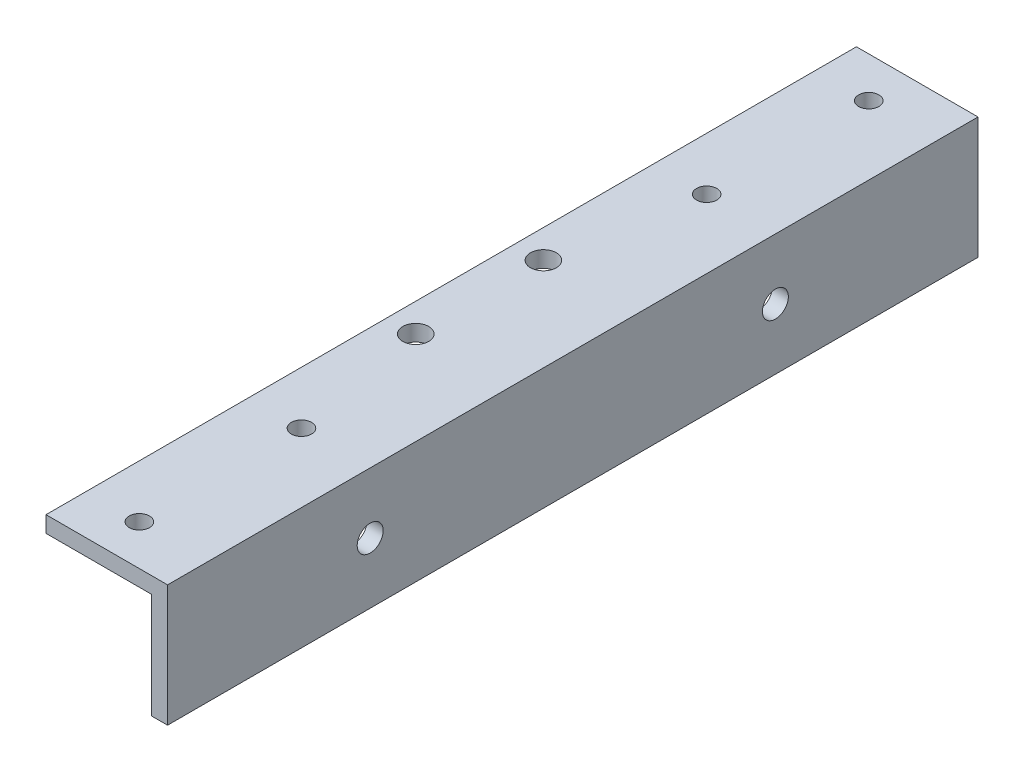
ISO-10303-21;
HEADER;
FILE_DESCRIPTION(('STEP AP214'),'2;1');
FILE_NAME('part.step','',(''),(''),'','','');
FILE_SCHEMA(('AUTOMOTIVE_DESIGN { 1 0 10303 214 1 1 1 1 }'));
ENDSEC;
DATA;
#1=APPLICATION_CONTEXT('core data for automotive mechanical design processes');
#2=APPLICATION_PROTOCOL_DEFINITION('international standard','automotive_design',2000,#1);
#3=PRODUCT_CONTEXT('',#1,'mechanical');
#4=PRODUCT('Part','Part','',(#3));
#5=PRODUCT_RELATED_PRODUCT_CATEGORY('part','',(#4));
#6=PRODUCT_DEFINITION_FORMATION('','',#4);
#7=PRODUCT_DEFINITION_CONTEXT('part definition',#1,'design');
#8=PRODUCT_DEFINITION('design','',#6,#7);
#9=PRODUCT_DEFINITION_SHAPE('','',#8);
#10=(LENGTH_UNIT() NAMED_UNIT(*) SI_UNIT(.MILLI.,.METRE.));
#11=(NAMED_UNIT(*) PLANE_ANGLE_UNIT() SI_UNIT($,.RADIAN.));
#12=(NAMED_UNIT(*) SI_UNIT($,.STERADIAN.) SOLID_ANGLE_UNIT());
#13=UNCERTAINTY_MEASURE_WITH_UNIT(LENGTH_MEASURE(1.E-05),#10,'distance_accuracy_value','');
#14=(GEOMETRIC_REPRESENTATION_CONTEXT(3) GLOBAL_UNCERTAINTY_ASSIGNED_CONTEXT((#13)) GLOBAL_UNIT_ASSIGNED_CONTEXT((#10,
#11,#12)) REPRESENTATION_CONTEXT('',''));
#15=CARTESIAN_POINT('',(0.,0.,0.));
#16=DIRECTION('',(0.,0.,1.));
#17=DIRECTION('',(1.,0.,0.));
#18=AXIS2_PLACEMENT_3D('',#15,#16,#17);
#19=CARTESIAN_POINT('',(0.,-2.,100.));
#20=DIRECTION('',(1.,0.,0.));
#21=DIRECTION('',(0.,0.,-1.));
#22=AXIS2_PLACEMENT_3D('',#19,#20,#21);
#23=PLANE('',#22);
#24=DIRECTION('',(0.,-1.,0.));
#25=VECTOR('',#24,1.);
#26=CARTESIAN_POINT('',(0.,-2.,0.));
#27=LINE('',#26,#25);
#28=CARTESIAN_POINT('',(0.,0.,0.));
#29=VERTEX_POINT('',#28);
#30=CARTESIAN_POINT('',(0.,-2.,0.));
#31=VERTEX_POINT('',#30);
#32=EDGE_CURVE('E121',#29,#31,#27,.T.);
#33=ORIENTED_EDGE('',*,*,#32,.T.);
#34=DIRECTION('',(0.,0.,-1.));
#35=VECTOR('',#34,1.);
#36=CARTESIAN_POINT('',(0.,-2.,100.));
#37=LINE('',#36,#35);
#38=CARTESIAN_POINT('',(0.,-2.,100.));
#39=VERTEX_POINT('',#38);
#40=EDGE_CURVE('E11',#39,#31,#37,.T.);
#41=ORIENTED_EDGE('',*,*,#40,.F.);
#42=DIRECTION('',(0.,-1.,0.));
#43=VECTOR('',#42,1.);
#44=CARTESIAN_POINT('',(0.,-2.,100.));
#45=LINE('',#44,#43);
#46=CARTESIAN_POINT('',(0.,0.,100.));
#47=VERTEX_POINT('',#46);
#48=EDGE_CURVE('E132',#47,#39,#45,.T.);
#49=ORIENTED_EDGE('',*,*,#48,.F.);
#50=DIRECTION('',(0.,0.,-1.));
#51=VECTOR('',#50,1.);
#52=CARTESIAN_POINT('',(0.,0.,100.));
#53=LINE('',#52,#51);
#54=EDGE_CURVE('E117',#47,#29,#53,.T.);
#55=ORIENTED_EDGE('',*,*,#54,.T.);
#56=EDGE_LOOP('',(#33,#41,#49,#55));
#57=FACE_BOUND('',#56,.T.);
#58=ADVANCED_FACE('F35',(#57),#23,.F.);
#59=CARTESIAN_POINT('',(13.,-2.,100.));
#60=DIRECTION('',(0.,1.,0.));
#61=DIRECTION('',(-1.,0.,0.));
#62=AXIS2_PLACEMENT_3D('',#59,#60,#61);
#63=PLANE('',#62);
#64=CARTESIAN_POINT('',(6.52,-2.,75.));
#65=DIRECTION('',(0.,1.,0.));
#66=DIRECTION('',(-1.,0.,0.));
#67=AXIS2_PLACEMENT_3D('',#64,#65,#66);
#68=CIRCLE('',#67,1.24999999999999);
#69=CARTESIAN_POINT('',(5.27000000000001,-2.,75.));
#70=VERTEX_POINT('',#69);
#71=EDGE_CURVE('E38',#70,#70,#68,.T.);
#72=ORIENTED_EDGE('',*,*,#71,.T.);
#73=EDGE_LOOP('',(#72));
#74=FACE_BOUND('',#73,.T.);
#75=CARTESIAN_POINT('',(6.52,-2.,25.));
#76=DIRECTION('',(0.,1.,0.));
#77=DIRECTION('',(-1.,0.,0.));
#78=AXIS2_PLACEMENT_3D('',#75,#76,#77);
#79=CIRCLE('',#78,1.24999999999999);
#80=CARTESIAN_POINT('',(5.27000000000001,-2.,25.));
#81=VERTEX_POINT('',#80);
#82=EDGE_CURVE('E351',#81,#81,#79,.T.);
#83=ORIENTED_EDGE('',*,*,#82,.T.);
#84=EDGE_LOOP('',(#83));
#85=FACE_BOUND('',#84,.T.);
#86=CARTESIAN_POINT('',(6.52,-2.,95.));
#87=DIRECTION('',(0.,1.,0.));
#88=DIRECTION('',(-1.,0.,0.));
#89=AXIS2_PLACEMENT_3D('',#86,#87,#88);
#90=CIRCLE('',#89,1.24999999999999);
#91=CARTESIAN_POINT('',(5.27000000000002,-2.,95.));
#92=VERTEX_POINT('',#91);
#93=EDGE_CURVE('E147',#92,#92,#90,.T.);
#94=ORIENTED_EDGE('',*,*,#93,.T.);
#95=EDGE_LOOP('',(#94));
#96=FACE_BOUND('',#95,.T.);
#97=CARTESIAN_POINT('',(6.52,-2.,5.));
#98=DIRECTION('',(0.,1.,0.));
#99=DIRECTION('',(-1.,0.,0.));
#100=AXIS2_PLACEMENT_3D('',#97,#98,#99);
#101=CIRCLE('',#100,1.24999999999999);
#102=CARTESIAN_POINT('',(5.27000000000001,-2.,5.));
#103=VERTEX_POINT('',#102);
#104=EDGE_CURVE('E137',#103,#103,#101,.T.);
#105=ORIENTED_EDGE('',*,*,#104,.T.);
#106=EDGE_LOOP('',(#105));
#107=FACE_BOUND('',#106,.T.);
#108=CARTESIAN_POINT('',(3.5,-2.,57.875));
#109=DIRECTION('',(0.,1.,0.));
#110=DIRECTION('',(0.,0.,1.));
#111=AXIS2_PLACEMENT_3D('',#108,#109,#110);
#112=CIRCLE('',#111,1.6);
#113=CARTESIAN_POINT('',(3.5,-2.,59.475));
#114=VERTEX_POINT('',#113);
#115=EDGE_CURVE('E125',#114,#114,#112,.T.);
#116=ORIENTED_EDGE('',*,*,#115,.T.);
#117=EDGE_LOOP('',(#116));
#118=FACE_BOUND('',#117,.T.);
#119=CARTESIAN_POINT('',(3.5,-2.,42.125));
#120=DIRECTION('',(0.,1.,0.));
#121=DIRECTION('',(0.,0.,1.));
#122=AXIS2_PLACEMENT_3D('',#119,#120,#121);
#123=CIRCLE('',#122,1.6);
#124=CARTESIAN_POINT('',(3.5,-2.,43.725));
#125=VERTEX_POINT('',#124);
#126=EDGE_CURVE('E144',#125,#125,#123,.T.);
#127=ORIENTED_EDGE('',*,*,#126,.T.);
#128=EDGE_LOOP('',(#127));
#129=FACE_BOUND('',#128,.T.);
#130=DIRECTION('',(1.,0.,0.));
#131=VECTOR('',#130,1.);
#132=CARTESIAN_POINT('',(13.,-2.,0.));
#133=LINE('',#132,#131);
#134=CARTESIAN_POINT('',(13.,-2.,0.));
#135=VERTEX_POINT('',#134);
#136=EDGE_CURVE('E124',#31,#135,#133,.T.);
#137=ORIENTED_EDGE('',*,*,#136,.T.);
#138=DIRECTION('',(0.,0.,-1.));
#139=VECTOR('',#138,1.);
#140=CARTESIAN_POINT('',(13.,-2.,100.));
#141=LINE('',#140,#139);
#142=CARTESIAN_POINT('',(13.,-2.,100.));
#143=VERTEX_POINT('',#142);
#144=EDGE_CURVE('E44',#143,#135,#141,.T.);
#145=ORIENTED_EDGE('',*,*,#144,.F.);
#146=DIRECTION('',(1.,0.,0.));
#147=VECTOR('',#146,1.);
#148=CARTESIAN_POINT('',(13.,-2.,100.));
#149=LINE('',#148,#147);
#150=EDGE_CURVE('E90',#39,#143,#149,.T.);
#151=ORIENTED_EDGE('',*,*,#150,.F.);
#152=ORIENTED_EDGE('',*,*,#40,.T.);
#153=EDGE_LOOP('',(#137,#145,#151,#152));
#154=FACE_BOUND('',#153,.T.);
#155=ADVANCED_FACE('F166',(#74,#85,#96,#107,#118,#129,#154),#63,.F.);
#156=CARTESIAN_POINT('',(13.,-15.,100.));
#157=DIRECTION('',(1.,0.,0.));
#158=DIRECTION('',(0.,0.,-1.));
#159=AXIS2_PLACEMENT_3D('',#156,#157,#158);
#160=PLANE('',#159);
#161=CARTESIAN_POINT('',(13.,-7.5,75.));
#162=DIRECTION('',(1.,0.,0.));
#163=DIRECTION('',(0.,0.,-1.));
#164=AXIS2_PLACEMENT_3D('',#161,#162,#163);
#165=CIRCLE('',#164,1.60000000000001);
#166=CARTESIAN_POINT('',(13.,-7.5,73.4));
#167=VERTEX_POINT('',#166);
#168=EDGE_CURVE('E361',#167,#167,#165,.T.);
#169=ORIENTED_EDGE('',*,*,#168,.T.);
#170=EDGE_LOOP('',(#169));
#171=FACE_BOUND('',#170,.T.);
#172=CARTESIAN_POINT('',(13.,-7.49999999999999,25.));
#173=DIRECTION('',(1.,0.,0.));
#174=DIRECTION('',(0.,0.,-1.));
#175=AXIS2_PLACEMENT_3D('',#172,#173,#174);
#176=CIRCLE('',#175,1.6);
#177=CARTESIAN_POINT('',(13.,-7.49999999999999,23.4));
#178=VERTEX_POINT('',#177);
#179=EDGE_CURVE('E364',#178,#178,#176,.T.);
#180=ORIENTED_EDGE('',*,*,#179,.T.);
#181=EDGE_LOOP('',(#180));
#182=FACE_BOUND('',#181,.T.);
#183=DIRECTION('',(0.,-1.,0.));
#184=VECTOR('',#183,1.);
#185=CARTESIAN_POINT('',(13.,-15.,0.));
#186=LINE('',#185,#184);
#187=CARTESIAN_POINT('',(13.,-15.,0.));
#188=VERTEX_POINT('',#187);
#189=EDGE_CURVE('E127',#135,#188,#186,.T.);
#190=ORIENTED_EDGE('',*,*,#189,.T.);
#191=DIRECTION('',(0.,0.,-1.));
#192=VECTOR('',#191,1.);
#193=CARTESIAN_POINT('',(13.,-15.,100.));
#194=LINE('',#193,#192);
#195=CARTESIAN_POINT('',(13.,-15.,100.));
#196=VERTEX_POINT('',#195);
#197=EDGE_CURVE('E112',#196,#188,#194,.T.);
#198=ORIENTED_EDGE('',*,*,#197,.F.);
#199=DIRECTION('',(0.,-1.,0.));
#200=VECTOR('',#199,1.);
#201=CARTESIAN_POINT('',(13.,-15.,100.));
#202=LINE('',#201,#200);
#203=EDGE_CURVE('E103',#143,#196,#202,.T.);
#204=ORIENTED_EDGE('',*,*,#203,.F.);
#205=ORIENTED_EDGE('',*,*,#144,.T.);
#206=EDGE_LOOP('',(#190,#198,#204,#205));
#207=FACE_BOUND('',#206,.T.);
#208=ADVANCED_FACE('F169',(#171,#182,#207),#160,.F.);
#209=CARTESIAN_POINT('',(15.,-15.,100.));
#210=DIRECTION('',(0.,1.,0.));
#211=DIRECTION('',(-1.,0.,0.));
#212=AXIS2_PLACEMENT_3D('',#209,#210,#211);
#213=PLANE('',#212);
#214=DIRECTION('',(1.,0.,0.));
#215=VECTOR('',#214,1.);
#216=CARTESIAN_POINT('',(15.,-15.,0.));
#217=LINE('',#216,#215);
#218=CARTESIAN_POINT('',(15.,-15.,0.));
#219=VERTEX_POINT('',#218);
#220=EDGE_CURVE('E111',#188,#219,#217,.T.);
#221=ORIENTED_EDGE('',*,*,#220,.T.);
#222=DIRECTION('',(0.,0.,-1.));
#223=VECTOR('',#222,1.);
#224=CARTESIAN_POINT('',(15.,-15.,100.));
#225=LINE('',#224,#223);
#226=CARTESIAN_POINT('',(15.,-15.,100.));
#227=VERTEX_POINT('',#226);
#228=EDGE_CURVE('E108',#227,#219,#225,.T.);
#229=ORIENTED_EDGE('',*,*,#228,.F.);
#230=DIRECTION('',(1.,0.,0.));
#231=VECTOR('',#230,1.);
#232=CARTESIAN_POINT('',(15.,-15.,100.));
#233=LINE('',#232,#231);
#234=EDGE_CURVE('E97',#196,#227,#233,.T.);
#235=ORIENTED_EDGE('',*,*,#234,.F.);
#236=ORIENTED_EDGE('',*,*,#197,.T.);
#237=EDGE_LOOP('',(#221,#229,#235,#236));
#238=FACE_BOUND('',#237,.T.);
#239=ADVANCED_FACE('F109',(#238),#213,.F.);
#240=CARTESIAN_POINT('',(15.,0.,100.));
#241=DIRECTION('',(-1.,0.,0.));
#242=DIRECTION('',(0.,-1.,0.));
#243=AXIS2_PLACEMENT_3D('',#240,#241,#242);
#244=PLANE('',#243);
#245=CARTESIAN_POINT('',(15.,-7.5,75.));
#246=DIRECTION('',(1.,0.,0.));
#247=DIRECTION('',(0.,1.,0.));
#248=AXIS2_PLACEMENT_3D('',#245,#246,#247);
#249=CIRCLE('',#248,1.60000000000001);
#250=CARTESIAN_POINT('',(15.,-5.89999999999999,75.));
#251=VERTEX_POINT('',#250);
#252=EDGE_CURVE('E367',#251,#251,#249,.T.);
#253=ORIENTED_EDGE('',*,*,#252,.F.);
#254=EDGE_LOOP('',(#253));
#255=FACE_BOUND('',#254,.T.);
#256=CARTESIAN_POINT('',(15.,-7.49999999999999,25.));
#257=DIRECTION('',(1.,0.,0.));
#258=DIRECTION('',(0.,1.,0.));
#259=AXIS2_PLACEMENT_3D('',#256,#257,#258);
#260=CIRCLE('',#259,1.6);
#261=CARTESIAN_POINT('',(15.,-5.89999999999999,25.));
#262=VERTEX_POINT('',#261);
#263=EDGE_CURVE('E368',#262,#262,#260,.T.);
#264=ORIENTED_EDGE('',*,*,#263,.F.);
#265=EDGE_LOOP('',(#264));
#266=FACE_BOUND('',#265,.T.);
#267=DIRECTION('',(0.,1.,0.));
#268=VECTOR('',#267,1.);
#269=CARTESIAN_POINT('',(15.,0.,0.));
#270=LINE('',#269,#268);
#271=CARTESIAN_POINT('',(15.,0.,0.));
#272=VERTEX_POINT('',#271);
#273=EDGE_CURVE('E76',#219,#272,#270,.T.);
#274=ORIENTED_EDGE('',*,*,#273,.T.);
#275=DIRECTION('',(0.,0.,-1.));
#276=VECTOR('',#275,1.);
#277=CARTESIAN_POINT('',(15.,0.,100.));
#278=LINE('',#277,#276);
#279=CARTESIAN_POINT('',(15.,0.,100.));
#280=VERTEX_POINT('',#279);
#281=EDGE_CURVE('E113',#280,#272,#278,.T.);
#282=ORIENTED_EDGE('',*,*,#281,.F.);
#283=DIRECTION('',(0.,1.,0.));
#284=VECTOR('',#283,1.);
#285=CARTESIAN_POINT('',(15.,0.,100.));
#286=LINE('',#285,#284);
#287=EDGE_CURVE('E101',#227,#280,#286,.T.);
#288=ORIENTED_EDGE('',*,*,#287,.F.);
#289=ORIENTED_EDGE('',*,*,#228,.T.);
#290=EDGE_LOOP('',(#274,#282,#288,#289));
#291=FACE_BOUND('',#290,.T.);
#292=ADVANCED_FACE('F115',(#255,#266,#291),#244,.F.);
#293=CARTESIAN_POINT('',(0.,0.,100.));
#294=DIRECTION('',(0.,-1.,0.));
#295=DIRECTION('',(0.,0.,-1.));
#296=AXIS2_PLACEMENT_3D('',#293,#294,#295);
#297=PLANE('',#296);
#298=CARTESIAN_POINT('',(6.52,0.,75.));
#299=DIRECTION('',(0.,1.,0.));
#300=DIRECTION('',(0.,0.,1.));
#301=AXIS2_PLACEMENT_3D('',#298,#299,#300);
#302=CIRCLE('',#301,1.24999999999999);
#303=CARTESIAN_POINT('',(6.52,0.,76.25));
#304=VERTEX_POINT('',#303);
#305=EDGE_CURVE('E358',#304,#304,#302,.T.);
#306=ORIENTED_EDGE('',*,*,#305,.F.);
#307=EDGE_LOOP('',(#306));
#308=FACE_BOUND('',#307,.T.);
#309=CARTESIAN_POINT('',(6.52,0.,25.));
#310=DIRECTION('',(0.,1.,0.));
#311=DIRECTION('',(0.,0.,1.));
#312=AXIS2_PLACEMENT_3D('',#309,#310,#311);
#313=CIRCLE('',#312,1.24999999999999);
#314=CARTESIAN_POINT('',(6.52,0.,26.25));
#315=VERTEX_POINT('',#314);
#316=EDGE_CURVE('E353',#315,#315,#313,.T.);
#317=ORIENTED_EDGE('',*,*,#316,.F.);
#318=EDGE_LOOP('',(#317));
#319=FACE_BOUND('',#318,.T.);
#320=CARTESIAN_POINT('',(6.52,0.,95.));
#321=DIRECTION('',(0.,1.,0.));
#322=DIRECTION('',(0.,0.,1.));
#323=AXIS2_PLACEMENT_3D('',#320,#321,#322);
#324=CIRCLE('',#323,1.24999999999999);
#325=CARTESIAN_POINT('',(6.52,0.,96.25));
#326=VERTEX_POINT('',#325);
#327=EDGE_CURVE('E152',#326,#326,#324,.T.);
#328=ORIENTED_EDGE('',*,*,#327,.F.);
#329=EDGE_LOOP('',(#328));
#330=FACE_BOUND('',#329,.T.);
#331=CARTESIAN_POINT('',(6.52,0.,5.));
#332=DIRECTION('',(0.,1.,0.));
#333=DIRECTION('',(0.,0.,1.));
#334=AXIS2_PLACEMENT_3D('',#331,#332,#333);
#335=CIRCLE('',#334,1.24999999999999);
#336=CARTESIAN_POINT('',(6.52,0.,6.24999999999999));
#337=VERTEX_POINT('',#336);
#338=EDGE_CURVE('E140',#337,#337,#335,.T.);
#339=ORIENTED_EDGE('',*,*,#338,.F.);
#340=EDGE_LOOP('',(#339));
#341=FACE_BOUND('',#340,.T.);
#342=CARTESIAN_POINT('',(3.5,0.,57.875));
#343=DIRECTION('',(0.,1.,0.));
#344=DIRECTION('',(0.,0.,1.));
#345=AXIS2_PLACEMENT_3D('',#342,#343,#344);
#346=CIRCLE('',#345,1.6);
#347=CARTESIAN_POINT('',(3.5,0.,59.475));
#348=VERTEX_POINT('',#347);
#349=EDGE_CURVE('E158',#348,#348,#346,.T.);
#350=ORIENTED_EDGE('',*,*,#349,.F.);
#351=EDGE_LOOP('',(#350));
#352=FACE_BOUND('',#351,.T.);
#353=CARTESIAN_POINT('',(3.5,0.,42.125));
#354=DIRECTION('',(0.,1.,0.));
#355=DIRECTION('',(0.,0.,1.));
#356=AXIS2_PLACEMENT_3D('',#353,#354,#355);
#357=CIRCLE('',#356,1.6);
#358=CARTESIAN_POINT('',(3.5,0.,43.725));
#359=VERTEX_POINT('',#358);
#360=EDGE_CURVE('E139',#359,#359,#357,.T.);
#361=ORIENTED_EDGE('',*,*,#360,.F.);
#362=EDGE_LOOP('',(#361));
#363=FACE_BOUND('',#362,.T.);
#364=DIRECTION('',(-1.,0.,0.));
#365=VECTOR('',#364,1.);
#366=CARTESIAN_POINT('',(0.,0.,0.));
#367=LINE('',#366,#365);
#368=EDGE_CURVE('E82',#272,#29,#367,.T.);
#369=ORIENTED_EDGE('',*,*,#368,.T.);
#370=ORIENTED_EDGE('',*,*,#54,.F.);
#371=DIRECTION('',(-1.,0.,0.));
#372=VECTOR('',#371,1.);
#373=CARTESIAN_POINT('',(0.,0.,100.));
#374=LINE('',#373,#372);
#375=EDGE_CURVE('E53',#280,#47,#374,.T.);
#376=ORIENTED_EDGE('',*,*,#375,.F.);
#377=ORIENTED_EDGE('',*,*,#281,.T.);
#378=EDGE_LOOP('',(#369,#370,#376,#377));
#379=FACE_BOUND('',#378,.T.);
#380=ADVANCED_FACE('F174',(#308,#319,#330,#341,#352,#363,#379),#297,.F.);
#381=CARTESIAN_POINT('',(0.,0.,100.));
#382=DIRECTION('',(0.,0.,-1.));
#383=DIRECTION('',(-1.,0.,0.));
#384=AXIS2_PLACEMENT_3D('',#381,#382,#383);
#385=PLANE('',#384);
#386=ORIENTED_EDGE('',*,*,#48,.T.);
#387=ORIENTED_EDGE('',*,*,#150,.T.);
#388=ORIENTED_EDGE('',*,*,#203,.T.);
#389=ORIENTED_EDGE('',*,*,#234,.T.);
#390=ORIENTED_EDGE('',*,*,#287,.T.);
#391=ORIENTED_EDGE('',*,*,#375,.T.);
#392=EDGE_LOOP('',(#386,#387,#388,#389,#390,#391));
#393=FACE_BOUND('',#392,.T.);
#394=ADVANCED_FACE('F99',(#393),#385,.F.);
#395=CARTESIAN_POINT('',(0.,0.,0.));
#396=DIRECTION('',(0.,0.,-1.));
#397=DIRECTION('',(-1.,0.,0.));
#398=AXIS2_PLACEMENT_3D('',#395,#396,#397);
#399=PLANE('',#398);
#400=ORIENTED_EDGE('',*,*,#32,.F.);
#401=ORIENTED_EDGE('',*,*,#368,.F.);
#402=ORIENTED_EDGE('',*,*,#273,.F.);
#403=ORIENTED_EDGE('',*,*,#220,.F.);
#404=ORIENTED_EDGE('',*,*,#189,.F.);
#405=ORIENTED_EDGE('',*,*,#136,.F.);
#406=EDGE_LOOP('',(#400,#401,#402,#403,#404,#405));
#407=FACE_BOUND('',#406,.T.);
#408=ADVANCED_FACE('F172',(#407),#399,.T.);
#409=CARTESIAN_POINT('',(3.5,-2.,42.125));
#410=DIRECTION('',(0.,1.,0.));
#411=DIRECTION('',(0.,0.,1.));
#412=AXIS2_PLACEMENT_3D('',#409,#410,#411);
#413=CYLINDRICAL_SURFACE('',#412,1.6);
#414=ORIENTED_EDGE('',*,*,#126,.F.);
#415=EDGE_LOOP('',(#414));
#416=FACE_BOUND('',#415,.T.);
#417=ORIENTED_EDGE('',*,*,#360,.T.);
#418=EDGE_LOOP('',(#417));
#419=FACE_BOUND('',#418,.T.);
#420=ADVANCED_FACE('F261',(#416,#419),#413,.F.);
#421=CARTESIAN_POINT('',(3.5,-2.,57.875));
#422=DIRECTION('',(0.,1.,0.));
#423=DIRECTION('',(0.,0.,1.));
#424=AXIS2_PLACEMENT_3D('',#421,#422,#423);
#425=CYLINDRICAL_SURFACE('',#424,1.6);
#426=ORIENTED_EDGE('',*,*,#115,.F.);
#427=EDGE_LOOP('',(#426));
#428=FACE_BOUND('',#427,.T.);
#429=ORIENTED_EDGE('',*,*,#349,.T.);
#430=EDGE_LOOP('',(#429));
#431=FACE_BOUND('',#430,.T.);
#432=ADVANCED_FACE('F258',(#428,#431),#425,.F.);
#433=CARTESIAN_POINT('',(6.52,0.,5.));
#434=DIRECTION('',(0.,1.,0.));
#435=DIRECTION('',(0.,0.,1.));
#436=AXIS2_PLACEMENT_3D('',#433,#434,#435);
#437=CYLINDRICAL_SURFACE('',#436,1.24999999999999);
#438=ORIENTED_EDGE('',*,*,#338,.T.);
#439=EDGE_LOOP('',(#438));
#440=FACE_BOUND('',#439,.T.);
#441=ORIENTED_EDGE('',*,*,#104,.F.);
#442=EDGE_LOOP('',(#441));
#443=FACE_BOUND('',#442,.T.);
#444=ADVANCED_FACE('F254',(#440,#443),#437,.F.);
#445=CARTESIAN_POINT('',(6.52,0.,95.));
#446=DIRECTION('',(0.,1.,0.));
#447=DIRECTION('',(0.,0.,1.));
#448=AXIS2_PLACEMENT_3D('',#445,#446,#447);
#449=CYLINDRICAL_SURFACE('',#448,1.24999999999999);
#450=ORIENTED_EDGE('',*,*,#327,.T.);
#451=EDGE_LOOP('',(#450));
#452=FACE_BOUND('',#451,.T.);
#453=ORIENTED_EDGE('',*,*,#93,.F.);
#454=EDGE_LOOP('',(#453));
#455=FACE_BOUND('',#454,.T.);
#456=ADVANCED_FACE('F250',(#452,#455),#449,.F.);
#457=CARTESIAN_POINT('',(6.52,0.,25.));
#458=DIRECTION('',(0.,1.,0.));
#459=DIRECTION('',(0.,0.,1.));
#460=AXIS2_PLACEMENT_3D('',#457,#458,#459);
#461=CYLINDRICAL_SURFACE('',#460,1.24999999999999);
#462=ORIENTED_EDGE('',*,*,#316,.T.);
#463=EDGE_LOOP('',(#462));
#464=FACE_BOUND('',#463,.T.);
#465=ORIENTED_EDGE('',*,*,#82,.F.);
#466=EDGE_LOOP('',(#465));
#467=FACE_BOUND('',#466,.T.);
#468=ADVANCED_FACE('F246',(#464,#467),#461,.F.);
#469=CARTESIAN_POINT('',(6.52,0.,75.));
#470=DIRECTION('',(0.,1.,0.));
#471=DIRECTION('',(0.,0.,1.));
#472=AXIS2_PLACEMENT_3D('',#469,#470,#471);
#473=CYLINDRICAL_SURFACE('',#472,1.24999999999999);
#474=ORIENTED_EDGE('',*,*,#305,.T.);
#475=EDGE_LOOP('',(#474));
#476=FACE_BOUND('',#475,.T.);
#477=ORIENTED_EDGE('',*,*,#71,.F.);
#478=EDGE_LOOP('',(#477));
#479=FACE_BOUND('',#478,.T.);
#480=ADVANCED_FACE('F226',(#476,#479),#473,.F.);
#481=CARTESIAN_POINT('',(5.,-7.5,25.));
#482=DIRECTION('',(1.,0.,0.));
#483=DIRECTION('',(0.,1.,0.));
#484=AXIS2_PLACEMENT_3D('',#481,#482,#483);
#485=CYLINDRICAL_SURFACE('',#484,1.6);
#486=ORIENTED_EDGE('',*,*,#263,.T.);
#487=EDGE_LOOP('',(#486));
#488=FACE_BOUND('',#487,.T.);
#489=ORIENTED_EDGE('',*,*,#179,.F.);
#490=EDGE_LOOP('',(#489));
#491=FACE_BOUND('',#490,.T.);
#492=ADVANCED_FACE('F220',(#488,#491),#485,.F.);
#493=CARTESIAN_POINT('',(5.,-7.5,75.));
#494=DIRECTION('',(1.,0.,0.));
#495=DIRECTION('',(0.,1.,0.));
#496=AXIS2_PLACEMENT_3D('',#493,#494,#495);
#497=CYLINDRICAL_SURFACE('',#496,1.60000000000001);
#498=ORIENTED_EDGE('',*,*,#252,.T.);
#499=EDGE_LOOP('',(#498));
#500=FACE_BOUND('',#499,.T.);
#501=ORIENTED_EDGE('',*,*,#168,.F.);
#502=EDGE_LOOP('',(#501));
#503=FACE_BOUND('',#502,.T.);
#504=ADVANCED_FACE('F225',(#500,#503),#497,.F.);
#505=CLOSED_SHELL('',(#58,#155,#208,#239,#292,#380,#394,#408,#420,#432,#444,#456,#468,#480,#492,#504));
#506=MANIFOLD_SOLID_BREP('B2',#505);
#507=ADVANCED_BREP_SHAPE_REPRESENTATION('',(#18,#506),#14);
#508=SHAPE_DEFINITION_REPRESENTATION(#9,#507);
ENDSEC;
END-ISO-10303-21;
